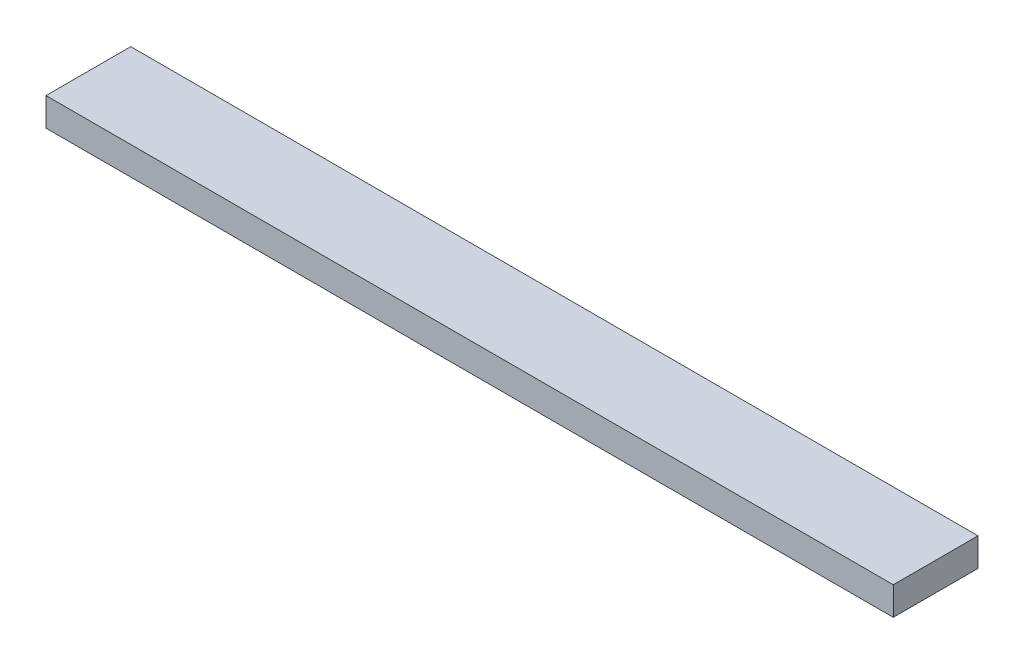
ISO-10303-21;
HEADER;
FILE_DESCRIPTION(('STEP AP214'),'2;1');
FILE_NAME('part.step','',(''),(''),'','','');
FILE_SCHEMA(('AUTOMOTIVE_DESIGN { 1 0 10303 214 1 1 1 1 }'));
ENDSEC;
DATA;
#1=APPLICATION_CONTEXT('core data for automotive mechanical design processes');
#2=APPLICATION_PROTOCOL_DEFINITION('international standard','automotive_design',2000,#1);
#3=PRODUCT_CONTEXT('',#1,'mechanical');
#4=PRODUCT('Part','Part','',(#3));
#5=PRODUCT_RELATED_PRODUCT_CATEGORY('part','',(#4));
#6=PRODUCT_DEFINITION_FORMATION('','',#4);
#7=PRODUCT_DEFINITION_CONTEXT('part definition',#1,'design');
#8=PRODUCT_DEFINITION('design','',#6,#7);
#9=PRODUCT_DEFINITION_SHAPE('','',#8);
#10=(LENGTH_UNIT() NAMED_UNIT(*) SI_UNIT(.MILLI.,.METRE.));
#11=(NAMED_UNIT(*) PLANE_ANGLE_UNIT() SI_UNIT($,.RADIAN.));
#12=(NAMED_UNIT(*) SI_UNIT($,.STERADIAN.) SOLID_ANGLE_UNIT());
#13=UNCERTAINTY_MEASURE_WITH_UNIT(LENGTH_MEASURE(1.E-05),#10,'distance_accuracy_value','');
#14=(GEOMETRIC_REPRESENTATION_CONTEXT(3) GLOBAL_UNCERTAINTY_ASSIGNED_CONTEXT((#13)) GLOBAL_UNIT_ASSIGNED_CONTEXT((#10,
#11,#12)) REPRESENTATION_CONTEXT('',''));
#15=CARTESIAN_POINT('',(0.,0.,0.));
#16=DIRECTION('',(0.,0.,1.));
#17=DIRECTION('',(1.,0.,0.));
#18=AXIS2_PLACEMENT_3D('',#15,#16,#17);
#19=CARTESIAN_POINT('',(150.,10.,15.));
#20=DIRECTION('',(-1.,0.,0.));
#21=DIRECTION('',(0.,0.,1.));
#22=AXIS2_PLACEMENT_3D('',#19,#20,#21);
#23=PLANE('',#22);
#24=DIRECTION('',(0.,0.,-1.));
#25=VECTOR('',#24,1.);
#26=CARTESIAN_POINT('',(150.,0.,15.));
#27=LINE('',#26,#25);
#28=CARTESIAN_POINT('',(150.,0.,15.));
#29=VERTEX_POINT('',#28);
#30=CARTESIAN_POINT('',(150.,0.,-15.));
#31=VERTEX_POINT('',#30);
#32=EDGE_CURVE('E111',#29,#31,#27,.T.);
#33=ORIENTED_EDGE('',*,*,#32,.T.);
#34=DIRECTION('',(0.,-1.,0.));
#35=VECTOR('',#34,1.);
#36=CARTESIAN_POINT('',(150.,10.,-15.));
#37=LINE('',#36,#35);
#38=CARTESIAN_POINT('',(150.,10.,-15.));
#39=VERTEX_POINT('',#38);
#40=EDGE_CURVE('E11',#39,#31,#37,.T.);
#41=ORIENTED_EDGE('',*,*,#40,.F.);
#42=DIRECTION('',(0.,0.,-1.));
#43=VECTOR('',#42,1.);
#44=CARTESIAN_POINT('',(150.,10.,15.));
#45=LINE('',#44,#43);
#46=CARTESIAN_POINT('',(150.,10.,15.));
#47=VERTEX_POINT('',#46);
#48=EDGE_CURVE('E95',#47,#39,#45,.T.);
#49=ORIENTED_EDGE('',*,*,#48,.F.);
#50=DIRECTION('',(0.,-1.,0.));
#51=VECTOR('',#50,1.);
#52=CARTESIAN_POINT('',(150.,10.,15.));
#53=LINE('',#52,#51);
#54=EDGE_CURVE('E107',#47,#29,#53,.T.);
#55=ORIENTED_EDGE('',*,*,#54,.T.);
#56=EDGE_LOOP('',(#33,#41,#49,#55));
#57=FACE_BOUND('',#56,.T.);
#58=ADVANCED_FACE('F43',(#57),#23,.F.);
#59=CARTESIAN_POINT('',(-150.,10.,-15.));
#60=DIRECTION('',(0.,0.,1.));
#61=DIRECTION('',(1.,0.,0.));
#62=AXIS2_PLACEMENT_3D('',#59,#60,#61);
#63=PLANE('',#62);
#64=DIRECTION('',(-1.,0.,0.));
#65=VECTOR('',#64,1.);
#66=CARTESIAN_POINT('',(-150.,0.,-15.));
#67=LINE('',#66,#65);
#68=CARTESIAN_POINT('',(-150.,0.,-15.));
#69=VERTEX_POINT('',#68);
#70=EDGE_CURVE('E100',#31,#69,#67,.T.);
#71=ORIENTED_EDGE('',*,*,#70,.T.);
#72=DIRECTION('',(0.,-1.,0.));
#73=VECTOR('',#72,1.);
#74=CARTESIAN_POINT('',(-150.,10.,-15.));
#75=LINE('',#74,#73);
#76=CARTESIAN_POINT('',(-150.,10.,-15.));
#77=VERTEX_POINT('',#76);
#78=EDGE_CURVE('E52',#77,#69,#75,.T.);
#79=ORIENTED_EDGE('',*,*,#78,.F.);
#80=DIRECTION('',(-1.,0.,0.));
#81=VECTOR('',#80,1.);
#82=CARTESIAN_POINT('',(-150.,10.,-15.));
#83=LINE('',#82,#81);
#84=EDGE_CURVE('E90',#39,#77,#83,.T.);
#85=ORIENTED_EDGE('',*,*,#84,.F.);
#86=ORIENTED_EDGE('',*,*,#40,.T.);
#87=EDGE_LOOP('',(#71,#79,#85,#86));
#88=FACE_BOUND('',#87,.T.);
#89=ADVANCED_FACE('F99',(#88),#63,.F.);
#90=CARTESIAN_POINT('',(-150.,10.,15.));
#91=DIRECTION('',(1.,0.,0.));
#92=DIRECTION('',(0.,0.,-1.));
#93=AXIS2_PLACEMENT_3D('',#90,#91,#92);
#94=PLANE('',#93);
#95=DIRECTION('',(0.,0.,1.));
#96=VECTOR('',#95,1.);
#97=CARTESIAN_POINT('',(-150.,0.,15.));
#98=LINE('',#97,#96);
#99=CARTESIAN_POINT('',(-150.,0.,15.));
#100=VERTEX_POINT('',#99);
#101=EDGE_CURVE('E77',#69,#100,#98,.T.);
#102=ORIENTED_EDGE('',*,*,#101,.T.);
#103=DIRECTION('',(0.,-1.,0.));
#104=VECTOR('',#103,1.);
#105=CARTESIAN_POINT('',(-150.,10.,15.));
#106=LINE('',#105,#104);
#107=CARTESIAN_POINT('',(-150.,10.,15.));
#108=VERTEX_POINT('',#107);
#109=EDGE_CURVE('E102',#108,#100,#106,.T.);
#110=ORIENTED_EDGE('',*,*,#109,.F.);
#111=DIRECTION('',(0.,0.,1.));
#112=VECTOR('',#111,1.);
#113=CARTESIAN_POINT('',(-150.,10.,15.));
#114=LINE('',#113,#112);
#115=EDGE_CURVE('E93',#77,#108,#114,.T.);
#116=ORIENTED_EDGE('',*,*,#115,.F.);
#117=ORIENTED_EDGE('',*,*,#78,.T.);
#118=EDGE_LOOP('',(#102,#110,#116,#117));
#119=FACE_BOUND('',#118,.T.);
#120=ADVANCED_FACE('F103',(#119),#94,.F.);
#121=CARTESIAN_POINT('',(-150.,10.,15.));
#122=DIRECTION('',(0.,0.,-1.));
#123=DIRECTION('',(-1.,0.,0.));
#124=AXIS2_PLACEMENT_3D('',#121,#122,#123);
#125=PLANE('',#124);
#126=DIRECTION('',(1.,0.,0.));
#127=VECTOR('',#126,1.);
#128=CARTESIAN_POINT('',(-150.,0.,15.));
#129=LINE('',#128,#127);
#130=EDGE_CURVE('E83',#100,#29,#129,.T.);
#131=ORIENTED_EDGE('',*,*,#130,.T.);
#132=ORIENTED_EDGE('',*,*,#54,.F.);
#133=DIRECTION('',(1.,0.,0.));
#134=VECTOR('',#133,1.);
#135=CARTESIAN_POINT('',(-150.,10.,15.));
#136=LINE('',#135,#134);
#137=EDGE_CURVE('E60',#108,#47,#136,.T.);
#138=ORIENTED_EDGE('',*,*,#137,.F.);
#139=ORIENTED_EDGE('',*,*,#109,.T.);
#140=EDGE_LOOP('',(#131,#132,#138,#139));
#141=FACE_BOUND('',#140,.T.);
#142=ADVANCED_FACE('F124',(#141),#125,.F.);
#143=CARTESIAN_POINT('',(0.,10.,0.));
#144=DIRECTION('',(0.,-1.,0.));
#145=DIRECTION('',(0.,0.,-1.));
#146=AXIS2_PLACEMENT_3D('',#143,#144,#145);
#147=PLANE('',#146);
#148=ORIENTED_EDGE('',*,*,#48,.T.);
#149=ORIENTED_EDGE('',*,*,#84,.T.);
#150=ORIENTED_EDGE('',*,*,#115,.T.);
#151=ORIENTED_EDGE('',*,*,#137,.T.);
#152=EDGE_LOOP('',(#148,#149,#150,#151));
#153=FACE_BOUND('',#152,.T.);
#154=ADVANCED_FACE('F91',(#153),#147,.F.);
#155=CARTESIAN_POINT('',(0.,0.,0.));
#156=DIRECTION('',(0.,-1.,0.));
#157=DIRECTION('',(0.,0.,-1.));
#158=AXIS2_PLACEMENT_3D('',#155,#156,#157);
#159=PLANE('',#158);
#160=ORIENTED_EDGE('',*,*,#32,.F.);
#161=ORIENTED_EDGE('',*,*,#130,.F.);
#162=ORIENTED_EDGE('',*,*,#101,.F.);
#163=ORIENTED_EDGE('',*,*,#70,.F.);
#164=EDGE_LOOP('',(#160,#161,#162,#163));
#165=FACE_BOUND('',#164,.T.);
#166=ADVANCED_FACE('F127',(#165),#159,.T.);
#167=CLOSED_SHELL('',(#58,#89,#120,#142,#154,#166));
#168=MANIFOLD_SOLID_BREP('B2',#167);
#169=ADVANCED_BREP_SHAPE_REPRESENTATION('',(#18,#168),#14);
#170=SHAPE_DEFINITION_REPRESENTATION(#9,#169);
ENDSEC;
END-ISO-10303-21;
